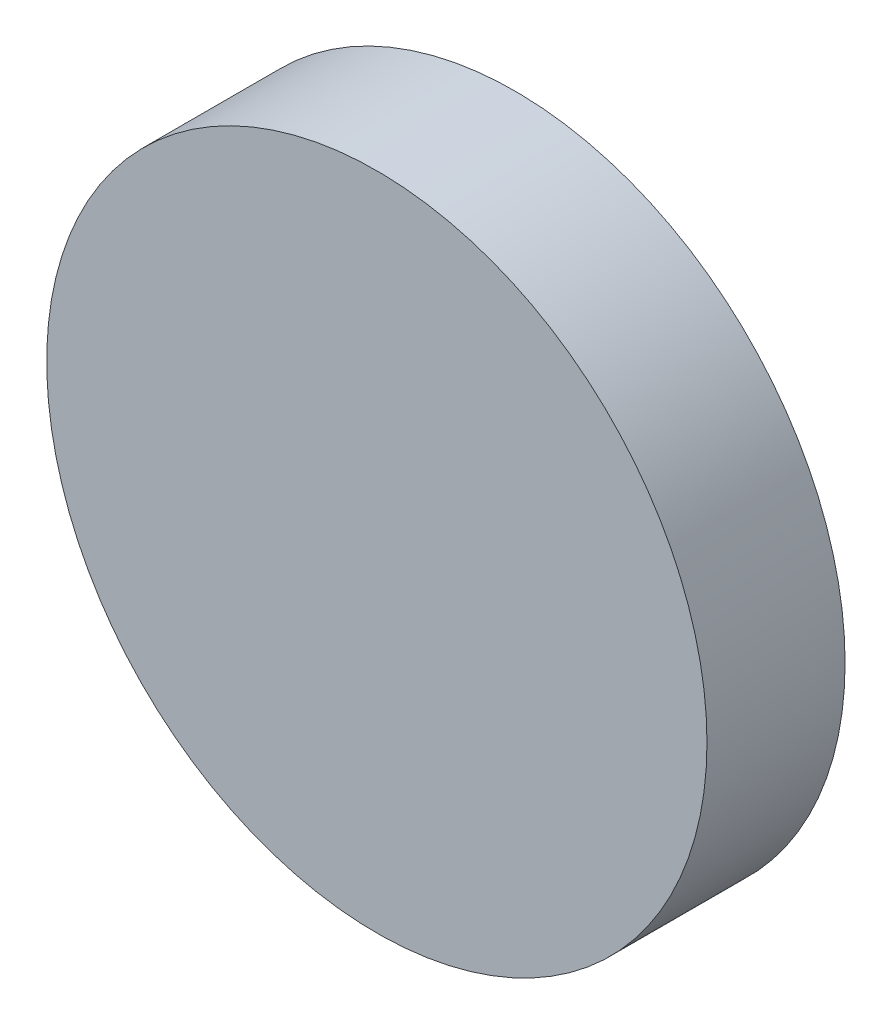
ISO-10303-21;
HEADER;
FILE_DESCRIPTION(('STEP AP214'),'2;1');
FILE_NAME('part.step','',(''),(''),'','','');
FILE_SCHEMA(('AUTOMOTIVE_DESIGN { 1 0 10303 214 1 1 1 1 }'));
ENDSEC;
DATA;
#1=APPLICATION_CONTEXT('core data for automotive mechanical design processes');
#2=APPLICATION_PROTOCOL_DEFINITION('international standard','automotive_design',2000,#1);
#3=PRODUCT_CONTEXT('',#1,'mechanical');
#4=PRODUCT('Part','Part','',(#3));
#5=PRODUCT_RELATED_PRODUCT_CATEGORY('part','',(#4));
#6=PRODUCT_DEFINITION_FORMATION('','',#4);
#7=PRODUCT_DEFINITION_CONTEXT('part definition',#1,'design');
#8=PRODUCT_DEFINITION('design','',#6,#7);
#9=PRODUCT_DEFINITION_SHAPE('','',#8);
#10=(LENGTH_UNIT() NAMED_UNIT(*) SI_UNIT(.MILLI.,.METRE.));
#11=(NAMED_UNIT(*) PLANE_ANGLE_UNIT() SI_UNIT($,.RADIAN.));
#12=(NAMED_UNIT(*) SI_UNIT($,.STERADIAN.) SOLID_ANGLE_UNIT());
#13=UNCERTAINTY_MEASURE_WITH_UNIT(LENGTH_MEASURE(1.E-05),#10,'distance_accuracy_value','');
#14=(GEOMETRIC_REPRESENTATION_CONTEXT(3) GLOBAL_UNCERTAINTY_ASSIGNED_CONTEXT((#13)) GLOBAL_UNIT_ASSIGNED_CONTEXT((#10,
#11,#12)) REPRESENTATION_CONTEXT('',''));
#15=CARTESIAN_POINT('',(0.,0.,0.));
#16=DIRECTION('',(0.,0.,1.));
#17=DIRECTION('',(1.,0.,0.));
#18=AXIS2_PLACEMENT_3D('',#15,#16,#17);
#19=CARTESIAN_POINT('',(0.,0.,19.05));
#20=DIRECTION('',(0.,0.,-1.));
#21=DIRECTION('',(-1.,0.,0.));
#22=AXIS2_PLACEMENT_3D('',#19,#20,#21);
#23=CYLINDRICAL_SURFACE('',#22,45.53585);
#24=CARTESIAN_POINT('',(0.,0.,19.05));
#25=DIRECTION('',(0.,0.,1.));
#26=DIRECTION('',(1.,0.,0.));
#27=AXIS2_PLACEMENT_3D('',#24,#25,#26);
#28=CIRCLE('',#27,45.53585);
#29=CARTESIAN_POINT('',(45.53585,0.,19.05));
#30=VERTEX_POINT('',#29);
#31=EDGE_CURVE('E10',#30,#30,#28,.T.);
#32=ORIENTED_EDGE('',*,*,#31,.F.);
#33=EDGE_LOOP('',(#32));
#34=FACE_BOUND('',#33,.T.);
#35=CARTESIAN_POINT('',(0.,0.,0.));
#36=DIRECTION('',(0.,0.,1.));
#37=DIRECTION('',(1.,0.,0.));
#38=AXIS2_PLACEMENT_3D('',#35,#36,#37);
#39=CIRCLE('',#38,45.53585);
#40=CARTESIAN_POINT('',(45.53585,0.,0.));
#41=VERTEX_POINT('',#40);
#42=EDGE_CURVE('E35',#41,#41,#39,.T.);
#43=ORIENTED_EDGE('',*,*,#42,.T.);
#44=EDGE_LOOP('',(#43));
#45=FACE_BOUND('',#44,.T.);
#46=ADVANCED_FACE('F32',(#34,#45),#23,.T.);
#47=CARTESIAN_POINT('',(0.,0.,19.05));
#48=DIRECTION('',(0.,0.,1.));
#49=DIRECTION('',(1.,0.,0.));
#50=AXIS2_PLACEMENT_3D('',#47,#48,#49);
#51=PLANE('',#50);
#52=ORIENTED_EDGE('',*,*,#31,.T.);
#53=EDGE_LOOP('',(#52));
#54=FACE_BOUND('',#53,.T.);
#55=ADVANCED_FACE('F47',(#54),#51,.T.);
#56=CARTESIAN_POINT('',(0.,0.,0.));
#57=DIRECTION('',(0.,0.,1.));
#58=DIRECTION('',(1.,0.,0.));
#59=AXIS2_PLACEMENT_3D('',#56,#57,#58);
#60=PLANE('',#59);
#61=ORIENTED_EDGE('',*,*,#42,.F.);
#62=EDGE_LOOP('',(#61));
#63=FACE_BOUND('',#62,.T.);
#64=ADVANCED_FACE('F45',(#63),#60,.F.);
#65=CLOSED_SHELL('',(#46,#55,#64));
#66=MANIFOLD_SOLID_BREP('B2',#65);
#67=ADVANCED_BREP_SHAPE_REPRESENTATION('',(#18,#66),#14);
#68=SHAPE_DEFINITION_REPRESENTATION(#9,#67);
ENDSEC;
END-ISO-10303-21;
